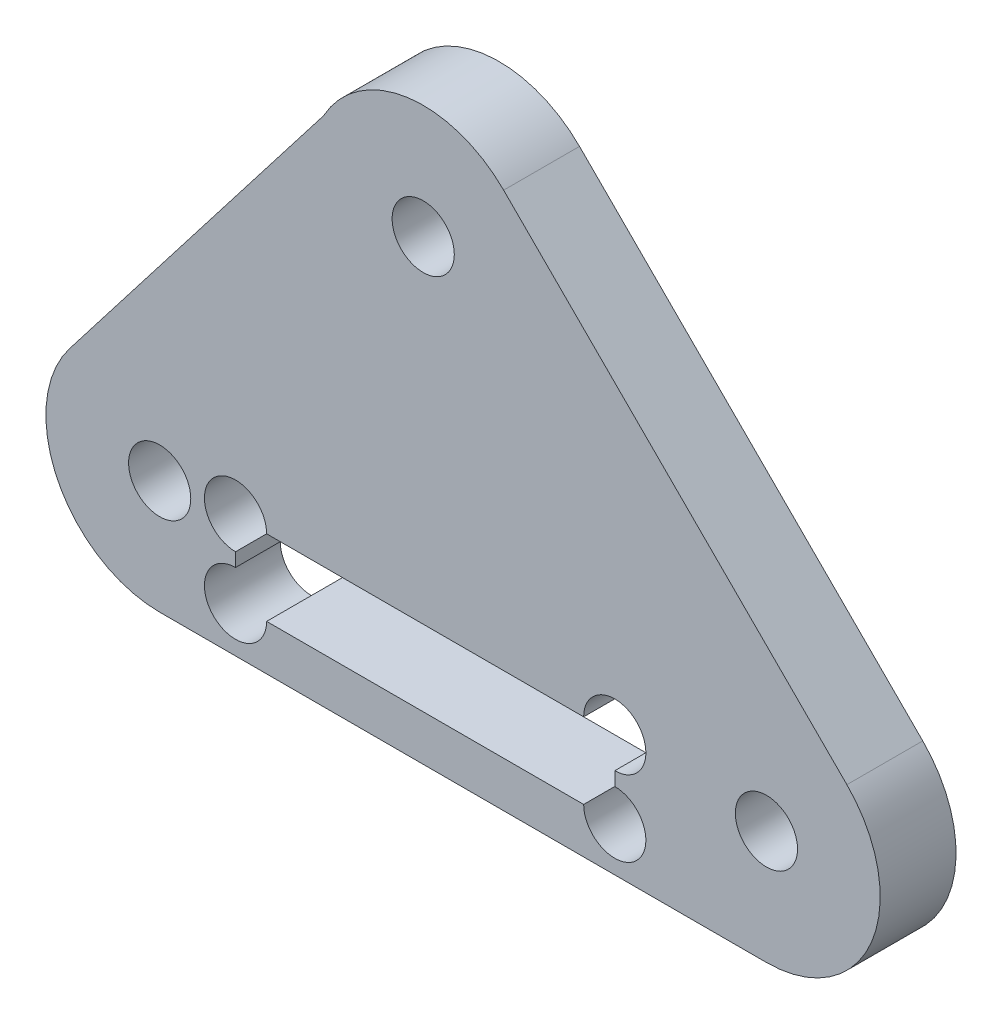
ISO-10303-21;
HEADER;
FILE_DESCRIPTION(('STEP AP214'),'2;1');
FILE_NAME('part.step','',(''),(''),'','','');
FILE_SCHEMA(('AUTOMOTIVE_DESIGN { 1 0 10303 214 1 1 1 1 }'));
ENDSEC;
DATA;
#1=APPLICATION_CONTEXT('core data for automotive mechanical design processes');
#2=APPLICATION_PROTOCOL_DEFINITION('international standard','automotive_design',2000,#1);
#3=PRODUCT_CONTEXT('',#1,'mechanical');
#4=PRODUCT('Part','Part','',(#3));
#5=PRODUCT_RELATED_PRODUCT_CATEGORY('part','',(#4));
#6=PRODUCT_DEFINITION_FORMATION('','',#4);
#7=PRODUCT_DEFINITION_CONTEXT('part definition',#1,'design');
#8=PRODUCT_DEFINITION('design','',#6,#7);
#9=PRODUCT_DEFINITION_SHAPE('','',#8);
#10=(LENGTH_UNIT() NAMED_UNIT(*) SI_UNIT(.MILLI.,.METRE.));
#11=(NAMED_UNIT(*) PLANE_ANGLE_UNIT() SI_UNIT($,.RADIAN.));
#12=(NAMED_UNIT(*) SI_UNIT($,.STERADIAN.) SOLID_ANGLE_UNIT());
#13=UNCERTAINTY_MEASURE_WITH_UNIT(LENGTH_MEASURE(1.E-05),#10,'distance_accuracy_value','');
#14=(GEOMETRIC_REPRESENTATION_CONTEXT(3) GLOBAL_UNCERTAINTY_ASSIGNED_CONTEXT((#13)) GLOBAL_UNIT_ASSIGNED_CONTEXT((#10,
#11,#12)) REPRESENTATION_CONTEXT('',''));
#15=CARTESIAN_POINT('',(0.,0.,0.));
#16=DIRECTION('',(0.,0.,1.));
#17=DIRECTION('',(1.,0.,0.));
#18=AXIS2_PLACEMENT_3D('',#15,#16,#17);
#19=CARTESIAN_POINT('',(0.,0.,5.));
#20=DIRECTION('',(0.,0.,1.));
#21=DIRECTION('',(1.,0.,0.));
#22=AXIS2_PLACEMENT_3D('',#19,#20,#21);
#23=PLANE('',#22);
#24=CARTESIAN_POINT('',(-10.,0.500000000000128,5.));
#25=DIRECTION('',(0.,0.,1.));
#26=DIRECTION('',(1.,0.,0.));
#27=AXIS2_PLACEMENT_3D('',#24,#25,#26);
#28=CIRCLE('',#27,2.05);
#29=CARTESIAN_POINT('',(-10.,-1.54999999999987,5.));
#30=VERTEX_POINT('',#29);
#31=CARTESIAN_POINT('',(-12.05,0.500000000000127,5.));
#32=VERTEX_POINT('',#31);
#33=EDGE_CURVE('E467',#30,#32,#28,.T.);
#34=ORIENTED_EDGE('',*,*,#33,.F.);
#35=DIRECTION('',(0.,1.,0.));
#36=VECTOR('',#35,1.);
#37=CARTESIAN_POINT('',(-10.,-4.49999999999987,5.));
#38=LINE('',#37,#36);
#39=CARTESIAN_POINT('',(-10.,-2.44999999999987,5.));
#40=VERTEX_POINT('',#39);
#41=EDGE_CURVE('E160',#40,#30,#38,.T.);
#42=ORIENTED_EDGE('',*,*,#41,.F.);
#43=CARTESIAN_POINT('',(-10.,-4.49999999999987,5.));
#44=DIRECTION('',(0.,0.,1.));
#45=DIRECTION('',(1.,0.,0.));
#46=AXIS2_PLACEMENT_3D('',#43,#44,#45);
#47=CIRCLE('',#46,2.05);
#48=CARTESIAN_POINT('',(-12.05,-4.49999999999987,5.));
#49=VERTEX_POINT('',#48);
#50=EDGE_CURVE('E59',#49,#40,#47,.T.);
#51=ORIENTED_EDGE('',*,*,#50,.F.);
#52=DIRECTION('',(1.,0.,0.));
#53=VECTOR('',#52,1.);
#54=CARTESIAN_POINT('',(-10.,-4.49999999999987,5.));
#55=LINE('',#54,#53);
#56=CARTESIAN_POINT('',(-32.95,-4.49999999999988,5.));
#57=VERTEX_POINT('',#56);
#58=EDGE_CURVE('E153',#57,#49,#55,.T.);
#59=ORIENTED_EDGE('',*,*,#58,.F.);
#60=CARTESIAN_POINT('',(-35.,-4.49999999999988,5.));
#61=DIRECTION('',(0.,0.,1.));
#62=DIRECTION('',(1.,0.,0.));
#63=AXIS2_PLACEMENT_3D('',#60,#61,#62);
#64=CIRCLE('',#63,2.04999999999999);
#65=CARTESIAN_POINT('',(-35.,-2.44999999999988,5.));
#66=VERTEX_POINT('',#65);
#67=EDGE_CURVE('E51',#66,#57,#64,.T.);
#68=ORIENTED_EDGE('',*,*,#67,.F.);
#69=DIRECTION('',(0.,-1.,0.));
#70=VECTOR('',#69,1.);
#71=CARTESIAN_POINT('',(-35.,-4.49999999999988,5.));
#72=LINE('',#71,#70);
#73=CARTESIAN_POINT('',(-35.,-1.54999999999988,5.));
#74=VERTEX_POINT('',#73);
#75=EDGE_CURVE('E151',#74,#66,#72,.T.);
#76=ORIENTED_EDGE('',*,*,#75,.F.);
#77=CARTESIAN_POINT('',(-35.,0.500000000000124,5.));
#78=DIRECTION('',(0.,0.,1.));
#79=DIRECTION('',(1.,0.,0.));
#80=AXIS2_PLACEMENT_3D('',#77,#78,#79);
#81=CIRCLE('',#80,2.05);
#82=CARTESIAN_POINT('',(-32.95,0.500000000000125,5.));
#83=VERTEX_POINT('',#82);
#84=EDGE_CURVE('E481',#83,#74,#81,.T.);
#85=ORIENTED_EDGE('',*,*,#84,.F.);
#86=DIRECTION('',(-1.,0.,0.));
#87=VECTOR('',#86,1.);
#88=CARTESIAN_POINT('',(-10.,0.500000000000128,5.));
#89=LINE('',#88,#87);
#90=EDGE_CURVE('E171',#32,#83,#89,.T.);
#91=ORIENTED_EDGE('',*,*,#90,.F.);
#92=EDGE_LOOP('',(#34,#42,#51,#59,#68,#76,#85,#91));
#93=FACE_BOUND('',#92,.T.);
#94=CARTESIAN_POINT('',(-22.6274169979697,22.6274169979694,5.));
#95=DIRECTION('',(0.,0.,1.));
#96=DIRECTION('',(1.,0.,0.));
#97=AXIS2_PLACEMENT_3D('',#94,#95,#96);
#98=CIRCLE('',#97,2.05);
#99=CARTESIAN_POINT('',(-20.5774169979697,22.6274169979694,5.));
#100=VERTEX_POINT('',#99);
#101=EDGE_CURVE('E178',#100,#100,#98,.T.);
#102=ORIENTED_EDGE('',*,*,#101,.F.);
#103=EDGE_LOOP('',(#102));
#104=FACE_BOUND('',#103,.T.);
#105=DIRECTION('',(1.,0.,0.));
#106=VECTOR('',#105,1.);
#107=CARTESIAN_POINT('',(-40.,-7.5,5.));
#108=LINE('',#107,#106);
#109=CARTESIAN_POINT('',(-40.,-7.49999999999994,5.));
#110=VERTEX_POINT('',#109);
#111=CARTESIAN_POINT('',(0.,-7.5,5.));
#112=VERTEX_POINT('',#111);
#113=EDGE_CURVE('E189',#110,#112,#108,.T.);
#114=ORIENTED_EDGE('',*,*,#113,.T.);
#115=CARTESIAN_POINT('',(0.,0.,5.));
#116=DIRECTION('',(0.,0.,1.));
#117=DIRECTION('',(1.,0.,0.));
#118=AXIS2_PLACEMENT_3D('',#115,#116,#117);
#119=CIRCLE('',#118,7.49999999999994);
#120=CARTESIAN_POINT('',(5.30330085889905,5.30330085889907,5.));
#121=VERTEX_POINT('',#120);
#122=EDGE_CURVE('E191',#112,#121,#119,.T.);
#123=ORIENTED_EDGE('',*,*,#122,.T.);
#124=DIRECTION('',(-0.707106781186549,0.707106781186546,0.));
#125=VECTOR('',#124,1.);
#126=CARTESIAN_POINT('',(-17.3241161390706,27.9307178568685,5.));
#127=LINE('',#126,#125);
#128=CARTESIAN_POINT('',(-17.3241161390706,27.9307178568685,5.));
#129=VERTEX_POINT('',#128);
#130=EDGE_CURVE('E194',#121,#129,#127,.T.);
#131=ORIENTED_EDGE('',*,*,#130,.T.);
#132=CARTESIAN_POINT('',(-22.6274169979697,22.6274169979694,5.));
#133=DIRECTION('',(0.,0.,1.));
#134=DIRECTION('',(-1.,0.,0.));
#135=AXIS2_PLACEMENT_3D('',#132,#133,#134);
#136=CIRCLE('',#135,7.5);
#137=CARTESIAN_POINT('',(-29.2018159304156,26.2367491629348,5.));
#138=VERTEX_POINT('',#137);
#139=EDGE_CURVE('E196',#129,#138,#136,.T.);
#140=ORIENTED_EDGE('',*,*,#139,.T.);
#141=DIRECTION('',(-0.611506676870263,-0.791239271107727,0.));
#142=VECTOR('',#141,1.);
#143=CARTESIAN_POINT('',(-45.9342945333079,4.5863000765269,5.));
#144=LINE('',#143,#142);
#145=CARTESIAN_POINT('',(-45.9342945333079,4.5863000765269,5.));
#146=VERTEX_POINT('',#145);
#147=EDGE_CURVE('E198',#138,#146,#144,.T.);
#148=ORIENTED_EDGE('',*,*,#147,.T.);
#149=CARTESIAN_POINT('',(-40.,0.,5.));
#150=DIRECTION('',(0.,0.,1.));
#151=DIRECTION('',(-1.,0.,0.));
#152=AXIS2_PLACEMENT_3D('',#149,#150,#151);
#153=CIRCLE('',#152,7.49999999999994);
#154=EDGE_CURVE('E200',#146,#110,#153,.T.);
#155=ORIENTED_EDGE('',*,*,#154,.T.);
#156=EDGE_LOOP('',(#114,#123,#131,#140,#148,#155));
#157=FACE_BOUND('',#156,.T.);
#158=CARTESIAN_POINT('',(0.,0.,5.));
#159=DIRECTION('',(0.,0.,1.));
#160=DIRECTION('',(1.,0.,0.));
#161=AXIS2_PLACEMENT_3D('',#158,#159,#160);
#162=CIRCLE('',#161,2.05);
#163=CARTESIAN_POINT('',(2.05,0.,5.));
#164=VERTEX_POINT('',#163);
#165=EDGE_CURVE('E183',#164,#164,#162,.T.);
#166=ORIENTED_EDGE('',*,*,#165,.F.);
#167=EDGE_LOOP('',(#166));
#168=FACE_BOUND('',#167,.T.);
#169=CARTESIAN_POINT('',(-40.,0.,5.));
#170=DIRECTION('',(0.,0.,1.));
#171=DIRECTION('',(1.,0.,0.));
#172=AXIS2_PLACEMENT_3D('',#169,#170,#171);
#173=CIRCLE('',#172,2.05);
#174=CARTESIAN_POINT('',(-37.95,0.,5.));
#175=VERTEX_POINT('',#174);
#176=EDGE_CURVE('E490',#175,#175,#173,.T.);
#177=ORIENTED_EDGE('',*,*,#176,.F.);
#178=EDGE_LOOP('',(#177));
#179=FACE_BOUND('',#178,.T.);
#180=ADVANCED_FACE('F36',(#93,#104,#157,#168,#179),#23,.T.);
#181=CARTESIAN_POINT('',(0.,0.,0.));
#182=DIRECTION('',(0.,0.,1.));
#183=DIRECTION('',(1.,0.,0.));
#184=AXIS2_PLACEMENT_3D('',#181,#182,#183);
#185=PLANE('',#184);
#186=CARTESIAN_POINT('',(0.,0.,0.));
#187=DIRECTION('',(0.,0.,1.));
#188=DIRECTION('',(1.,0.,0.));
#189=AXIS2_PLACEMENT_3D('',#186,#187,#188);
#190=CIRCLE('',#189,2.05);
#191=CARTESIAN_POINT('',(2.05,0.,0.));
#192=VERTEX_POINT('',#191);
#193=EDGE_CURVE('E174',#192,#192,#190,.T.);
#194=ORIENTED_EDGE('',*,*,#193,.T.);
#195=EDGE_LOOP('',(#194));
#196=FACE_BOUND('',#195,.T.);
#197=DIRECTION('',(1.,0.,0.));
#198=VECTOR('',#197,1.);
#199=CARTESIAN_POINT('',(-22.6274169979696,-7.5,0.));
#200=LINE('',#199,#198);
#201=CARTESIAN_POINT('',(-40.,-7.49999999999994,0.));
#202=VERTEX_POINT('',#201);
#203=CARTESIAN_POINT('',(0.,-7.5,0.));
#204=VERTEX_POINT('',#203);
#205=EDGE_CURVE('E186',#202,#204,#200,.T.);
#206=ORIENTED_EDGE('',*,*,#205,.F.);
#207=CARTESIAN_POINT('',(-40.,0.,0.));
#208=DIRECTION('',(0.,0.,1.));
#209=DIRECTION('',(-1.,0.,0.));
#210=AXIS2_PLACEMENT_3D('',#207,#208,#209);
#211=CIRCLE('',#210,7.49999999999994);
#212=CARTESIAN_POINT('',(-45.9342945333079,4.5863000765269,0.));
#213=VERTEX_POINT('',#212);
#214=EDGE_CURVE('E192',#213,#202,#211,.T.);
#215=ORIENTED_EDGE('',*,*,#214,.F.);
#216=DIRECTION('',(-0.611506676870263,-0.791239271107727,0.));
#217=VECTOR('',#216,1.);
#218=CARTESIAN_POINT('',(-45.9342945333079,4.5863000765269,0.));
#219=LINE('',#218,#217);
#220=CARTESIAN_POINT('',(-29.2018159304156,26.2367491629348,0.));
#221=VERTEX_POINT('',#220);
#222=EDGE_CURVE('E210',#221,#213,#219,.T.);
#223=ORIENTED_EDGE('',*,*,#222,.F.);
#224=CARTESIAN_POINT('',(-22.6274169979697,22.6274169979694,0.));
#225=DIRECTION('',(0.,0.,1.));
#226=DIRECTION('',(-1.,0.,0.));
#227=AXIS2_PLACEMENT_3D('',#224,#225,#226);
#228=CIRCLE('',#227,7.5);
#229=CARTESIAN_POINT('',(-17.3241161390706,27.9307178568685,0.));
#230=VERTEX_POINT('',#229);
#231=EDGE_CURVE('E208',#230,#221,#228,.T.);
#232=ORIENTED_EDGE('',*,*,#231,.F.);
#233=DIRECTION('',(-0.707106781186549,0.707106781186546,0.));
#234=VECTOR('',#233,1.);
#235=CARTESIAN_POINT('',(-17.3241161390706,27.9307178568685,0.));
#236=LINE('',#235,#234);
#237=CARTESIAN_POINT('',(5.30330085889905,5.30330085889907,0.));
#238=VERTEX_POINT('',#237);
#239=EDGE_CURVE('E206',#238,#230,#236,.T.);
#240=ORIENTED_EDGE('',*,*,#239,.F.);
#241=CARTESIAN_POINT('',(0.,0.,0.));
#242=DIRECTION('',(0.,0.,1.));
#243=DIRECTION('',(1.,0.,0.));
#244=AXIS2_PLACEMENT_3D('',#241,#242,#243);
#245=CIRCLE('',#244,7.49999999999994);
#246=EDGE_CURVE('E204',#204,#238,#245,.T.);
#247=ORIENTED_EDGE('',*,*,#246,.F.);
#248=EDGE_LOOP('',(#206,#215,#223,#232,#240,#247));
#249=FACE_BOUND('',#248,.T.);
#250=DIRECTION('',(0.,1.,0.));
#251=VECTOR('',#250,1.);
#252=CARTESIAN_POINT('',(-10.,-4.49999999999987,0.));
#253=LINE('',#252,#251);
#254=CARTESIAN_POINT('',(-10.,-2.44999999999987,0.));
#255=VERTEX_POINT('',#254);
#256=CARTESIAN_POINT('',(-10.,-1.54999999999987,0.));
#257=VERTEX_POINT('',#256);
#258=EDGE_CURVE('E163',#255,#257,#253,.T.);
#259=ORIENTED_EDGE('',*,*,#258,.T.);
#260=CARTESIAN_POINT('',(-10.,0.500000000000128,0.));
#261=DIRECTION('',(0.,0.,1.));
#262=DIRECTION('',(1.,0.,0.));
#263=AXIS2_PLACEMENT_3D('',#260,#261,#262);
#264=CIRCLE('',#263,2.05);
#265=CARTESIAN_POINT('',(-12.05,0.500000000000127,0.));
#266=VERTEX_POINT('',#265);
#267=EDGE_CURVE('E475',#266,#257,#264,.F.);
#268=ORIENTED_EDGE('',*,*,#267,.F.);
#269=DIRECTION('',(-1.,0.,0.));
#270=VECTOR('',#269,1.);
#271=CARTESIAN_POINT('',(-10.,0.500000000000128,0.));
#272=LINE('',#271,#270);
#273=CARTESIAN_POINT('',(-32.95,0.500000000000125,0.));
#274=VERTEX_POINT('',#273);
#275=EDGE_CURVE('E158',#266,#274,#272,.T.);
#276=ORIENTED_EDGE('',*,*,#275,.T.);
#277=CARTESIAN_POINT('',(-35.,0.500000000000124,0.));
#278=DIRECTION('',(0.,0.,1.));
#279=DIRECTION('',(1.,0.,0.));
#280=AXIS2_PLACEMENT_3D('',#277,#278,#279);
#281=CIRCLE('',#280,2.05);
#282=CARTESIAN_POINT('',(-35.,-1.54999999999988,0.));
#283=VERTEX_POINT('',#282);
#284=EDGE_CURVE('E482',#283,#274,#281,.F.);
#285=ORIENTED_EDGE('',*,*,#284,.F.);
#286=DIRECTION('',(0.,-1.,0.));
#287=VECTOR('',#286,1.);
#288=CARTESIAN_POINT('',(-35.,-4.49999999999988,0.));
#289=LINE('',#288,#287);
#290=CARTESIAN_POINT('',(-35.,-2.44999999999988,0.));
#291=VERTEX_POINT('',#290);
#292=EDGE_CURVE('E175',#283,#291,#289,.T.);
#293=ORIENTED_EDGE('',*,*,#292,.T.);
#294=CARTESIAN_POINT('',(-35.,-4.49999999999988,0.));
#295=DIRECTION('',(0.,0.,1.));
#296=DIRECTION('',(1.,0.,0.));
#297=AXIS2_PLACEMENT_3D('',#294,#295,#296);
#298=CIRCLE('',#297,2.04999999999999);
#299=CARTESIAN_POINT('',(-32.95,-4.49999999999988,0.));
#300=VERTEX_POINT('',#299);
#301=EDGE_CURVE('E138',#300,#291,#298,.F.);
#302=ORIENTED_EDGE('',*,*,#301,.F.);
#303=DIRECTION('',(1.,0.,0.));
#304=VECTOR('',#303,1.);
#305=CARTESIAN_POINT('',(-10.,-4.49999999999987,0.));
#306=LINE('',#305,#304);
#307=CARTESIAN_POINT('',(-12.05,-4.49999999999987,0.));
#308=VERTEX_POINT('',#307);
#309=EDGE_CURVE('E177',#300,#308,#306,.T.);
#310=ORIENTED_EDGE('',*,*,#309,.T.);
#311=CARTESIAN_POINT('',(-10.,-4.49999999999987,0.));
#312=DIRECTION('',(0.,0.,1.));
#313=DIRECTION('',(1.,0.,0.));
#314=AXIS2_PLACEMENT_3D('',#311,#312,#313);
#315=CIRCLE('',#314,2.05);
#316=EDGE_CURVE('E479',#255,#308,#315,.F.);
#317=ORIENTED_EDGE('',*,*,#316,.F.);
#318=EDGE_LOOP('',(#259,#268,#276,#285,#293,#302,#310,#317));
#319=FACE_BOUND('',#318,.T.);
#320=CARTESIAN_POINT('',(-22.6274169979697,22.6274169979694,0.));
#321=DIRECTION('',(0.,0.,1.));
#322=DIRECTION('',(1.,0.,0.));
#323=AXIS2_PLACEMENT_3D('',#320,#321,#322);
#324=CIRCLE('',#323,2.05);
#325=CARTESIAN_POINT('',(-20.5774169979697,22.6274169979694,0.));
#326=VERTEX_POINT('',#325);
#327=EDGE_CURVE('E166',#326,#326,#324,.T.);
#328=ORIENTED_EDGE('',*,*,#327,.T.);
#329=EDGE_LOOP('',(#328));
#330=FACE_BOUND('',#329,.T.);
#331=CARTESIAN_POINT('',(-40.,0.,0.));
#332=DIRECTION('',(0.,0.,1.));
#333=DIRECTION('',(1.,0.,0.));
#334=AXIS2_PLACEMENT_3D('',#331,#332,#333);
#335=CIRCLE('',#334,2.05);
#336=CARTESIAN_POINT('',(-37.95,0.,0.));
#337=VERTEX_POINT('',#336);
#338=EDGE_CURVE('E484',#337,#337,#335,.T.);
#339=ORIENTED_EDGE('',*,*,#338,.T.);
#340=EDGE_LOOP('',(#339));
#341=FACE_BOUND('',#340,.T.);
#342=ADVANCED_FACE('F236',(#196,#249,#319,#330,#341),#185,.F.);
#343=CARTESIAN_POINT('',(-22.6274169979696,-7.5,5.));
#344=DIRECTION('',(0.,1.,0.));
#345=DIRECTION('',(-1.,0.,0.));
#346=AXIS2_PLACEMENT_3D('',#343,#344,#345);
#347=PLANE('',#346);
#348=ORIENTED_EDGE('',*,*,#205,.T.);
#349=DIRECTION('',(0.,0.,-1.));
#350=VECTOR('',#349,1.);
#351=CARTESIAN_POINT('',(0.,-7.5,5.));
#352=LINE('',#351,#350);
#353=EDGE_CURVE('E11',#112,#204,#352,.T.);
#354=ORIENTED_EDGE('',*,*,#353,.F.);
#355=ORIENTED_EDGE('',*,*,#113,.F.);
#356=DIRECTION('',(0.,0.,-1.));
#357=VECTOR('',#356,1.);
#358=CARTESIAN_POINT('',(-40.,-7.49999999999994,5.));
#359=LINE('',#358,#357);
#360=EDGE_CURVE('E202',#110,#202,#359,.T.);
#361=ORIENTED_EDGE('',*,*,#360,.T.);
#362=EDGE_LOOP('',(#348,#354,#355,#361));
#363=FACE_BOUND('',#362,.T.);
#364=ADVANCED_FACE('F38',(#363),#347,.F.);
#365=CARTESIAN_POINT('',(0.,0.,5.));
#366=DIRECTION('',(0.,0.,-1.));
#367=DIRECTION('',(-1.,0.,0.));
#368=AXIS2_PLACEMENT_3D('',#365,#366,#367);
#369=CYLINDRICAL_SURFACE('',#368,7.49999999999994);
#370=ORIENTED_EDGE('',*,*,#246,.T.);
#371=DIRECTION('',(0.,0.,-1.));
#372=VECTOR('',#371,1.);
#373=CARTESIAN_POINT('',(5.30330085889905,5.30330085889907,5.));
#374=LINE('',#373,#372);
#375=EDGE_CURVE('E44',#121,#238,#374,.T.);
#376=ORIENTED_EDGE('',*,*,#375,.F.);
#377=ORIENTED_EDGE('',*,*,#122,.F.);
#378=ORIENTED_EDGE('',*,*,#353,.T.);
#379=EDGE_LOOP('',(#370,#376,#377,#378));
#380=FACE_BOUND('',#379,.T.);
#381=ADVANCED_FACE('F254',(#380),#369,.T.);
#382=CARTESIAN_POINT('',(-17.3241161390706,27.9307178568685,5.));
#383=DIRECTION('',(-0.707106781186546,-0.707106781186549,0.));
#384=DIRECTION('',(0.707106781186549,-0.707106781186546,0.));
#385=AXIS2_PLACEMENT_3D('',#382,#383,#384);
#386=PLANE('',#385);
#387=ORIENTED_EDGE('',*,*,#239,.T.);
#388=DIRECTION('',(0.,0.,-1.));
#389=VECTOR('',#388,1.);
#390=CARTESIAN_POINT('',(-17.3241161390706,27.9307178568685,5.));
#391=LINE('',#390,#389);
#392=EDGE_CURVE('E222',#129,#230,#391,.T.);
#393=ORIENTED_EDGE('',*,*,#392,.F.);
#394=ORIENTED_EDGE('',*,*,#130,.F.);
#395=ORIENTED_EDGE('',*,*,#375,.T.);
#396=EDGE_LOOP('',(#387,#393,#394,#395));
#397=FACE_BOUND('',#396,.T.);
#398=ADVANCED_FACE('F229',(#397),#386,.F.);
#399=CARTESIAN_POINT('',(-22.6274169979697,22.6274169979694,5.));
#400=DIRECTION('',(0.,0.,-1.));
#401=DIRECTION('',(-1.,0.,0.));
#402=AXIS2_PLACEMENT_3D('',#399,#400,#401);
#403=CYLINDRICAL_SURFACE('',#402,7.5);
#404=ORIENTED_EDGE('',*,*,#231,.T.);
#405=DIRECTION('',(0.,0.,-1.));
#406=VECTOR('',#405,1.);
#407=CARTESIAN_POINT('',(-29.2018159304156,26.2367491629348,5.));
#408=LINE('',#407,#406);
#409=EDGE_CURVE('E219',#138,#221,#408,.T.);
#410=ORIENTED_EDGE('',*,*,#409,.F.);
#411=ORIENTED_EDGE('',*,*,#139,.F.);
#412=ORIENTED_EDGE('',*,*,#392,.T.);
#413=EDGE_LOOP('',(#404,#410,#411,#412));
#414=FACE_BOUND('',#413,.T.);
#415=ADVANCED_FACE('F242',(#414),#403,.T.);
#416=CARTESIAN_POINT('',(-45.9342945333079,4.5863000765269,5.));
#417=DIRECTION('',(0.791239271107727,-0.611506676870263,0.));
#418=DIRECTION('',(0.611506676870263,0.791239271107727,0.));
#419=AXIS2_PLACEMENT_3D('',#416,#417,#418);
#420=PLANE('',#419);
#421=ORIENTED_EDGE('',*,*,#222,.T.);
#422=DIRECTION('',(0.,0.,-1.));
#423=VECTOR('',#422,1.);
#424=CARTESIAN_POINT('',(-45.9342945333079,4.5863000765269,5.));
#425=LINE('',#424,#423);
#426=EDGE_CURVE('E216',#146,#213,#425,.T.);
#427=ORIENTED_EDGE('',*,*,#426,.F.);
#428=ORIENTED_EDGE('',*,*,#147,.F.);
#429=ORIENTED_EDGE('',*,*,#409,.T.);
#430=EDGE_LOOP('',(#421,#427,#428,#429));
#431=FACE_BOUND('',#430,.T.);
#432=ADVANCED_FACE('F246',(#431),#420,.F.);
#433=CARTESIAN_POINT('',(-40.,0.,5.));
#434=DIRECTION('',(0.,0.,-1.));
#435=DIRECTION('',(-1.,0.,0.));
#436=AXIS2_PLACEMENT_3D('',#433,#434,#435);
#437=CYLINDRICAL_SURFACE('',#436,7.49999999999994);
#438=ORIENTED_EDGE('',*,*,#214,.T.);
#439=ORIENTED_EDGE('',*,*,#360,.F.);
#440=ORIENTED_EDGE('',*,*,#154,.F.);
#441=ORIENTED_EDGE('',*,*,#426,.T.);
#442=EDGE_LOOP('',(#438,#439,#440,#441));
#443=FACE_BOUND('',#442,.T.);
#444=ADVANCED_FACE('F257',(#443),#437,.T.);
#445=CARTESIAN_POINT('',(0.,0.,5.));
#446=DIRECTION('',(0.,0.,-1.));
#447=DIRECTION('',(-1.,0.,0.));
#448=AXIS2_PLACEMENT_3D('',#445,#446,#447);
#449=CYLINDRICAL_SURFACE('',#448,2.05);
#450=ORIENTED_EDGE('',*,*,#165,.T.);
#451=EDGE_LOOP('',(#450));
#452=FACE_BOUND('',#451,.T.);
#453=ORIENTED_EDGE('',*,*,#193,.F.);
#454=EDGE_LOOP('',(#453));
#455=FACE_BOUND('',#454,.T.);
#456=ADVANCED_FACE('F259',(#452,#455),#449,.F.);
#457=CARTESIAN_POINT('',(-35.,-4.49999999999988,5.));
#458=DIRECTION('',(1.,0.,0.));
#459=DIRECTION('',(0.,1.,0.));
#460=AXIS2_PLACEMENT_3D('',#457,#458,#459);
#461=PLANE('',#460);
#462=DIRECTION('',(0.,0.,1.));
#463=VECTOR('',#462,1.);
#464=CARTESIAN_POINT('',(-35.,-2.44999999999988,-0.00100000000000013));
#465=LINE('',#464,#463);
#466=EDGE_CURVE('E135',#66,#291,#465,.F.);
#467=ORIENTED_EDGE('',*,*,#466,.T.);
#468=ORIENTED_EDGE('',*,*,#292,.F.);
#469=DIRECTION('',(0.,0.,1.));
#470=VECTOR('',#469,1.);
#471=CARTESIAN_POINT('',(-35.,-1.54999999999988,-0.00100000000000013));
#472=LINE('',#471,#470);
#473=EDGE_CURVE('E157',#283,#74,#472,.T.);
#474=ORIENTED_EDGE('',*,*,#473,.T.);
#475=ORIENTED_EDGE('',*,*,#75,.T.);
#476=EDGE_LOOP('',(#467,#468,#474,#475));
#477=FACE_BOUND('',#476,.T.);
#478=ADVANCED_FACE('F156',(#477),#461,.T.);
#479=CARTESIAN_POINT('',(-10.,-4.49999999999987,5.));
#480=DIRECTION('',(0.,1.,0.));
#481=DIRECTION('',(-1.,0.,0.));
#482=AXIS2_PLACEMENT_3D('',#479,#480,#481);
#483=PLANE('',#482);
#484=DIRECTION('',(0.,0.,1.));
#485=VECTOR('',#484,1.);
#486=CARTESIAN_POINT('',(-12.05,-4.49999999999987,-0.00100000000000013));
#487=LINE('',#486,#485);
#488=EDGE_CURVE('E510',#49,#308,#487,.F.);
#489=ORIENTED_EDGE('',*,*,#488,.T.);
#490=ORIENTED_EDGE('',*,*,#309,.F.);
#491=DIRECTION('',(0.,0.,1.));
#492=VECTOR('',#491,1.);
#493=CARTESIAN_POINT('',(-32.95,-4.49999999999988,-0.00100000000000013));
#494=LINE('',#493,#492);
#495=EDGE_CURVE('E143',#300,#57,#494,.T.);
#496=ORIENTED_EDGE('',*,*,#495,.T.);
#497=ORIENTED_EDGE('',*,*,#58,.T.);
#498=EDGE_LOOP('',(#489,#490,#496,#497));
#499=FACE_BOUND('',#498,.T.);
#500=ADVANCED_FACE('F278',(#499),#483,.T.);
#501=CARTESIAN_POINT('',(-10.,-4.49999999999987,5.));
#502=DIRECTION('',(-1.,0.,0.));
#503=DIRECTION('',(0.,0.,1.));
#504=AXIS2_PLACEMENT_3D('',#501,#502,#503);
#505=PLANE('',#504);
#506=DIRECTION('',(0.,0.,1.));
#507=VECTOR('',#506,1.);
#508=CARTESIAN_POINT('',(-10.,-1.54999999999987,-0.00100000000000013));
#509=LINE('',#508,#507);
#510=EDGE_CURVE('E472',#30,#257,#509,.F.);
#511=ORIENTED_EDGE('',*,*,#510,.T.);
#512=ORIENTED_EDGE('',*,*,#258,.F.);
#513=DIRECTION('',(0.,0.,1.));
#514=VECTOR('',#513,1.);
#515=CARTESIAN_POINT('',(-10.,-2.44999999999987,-0.00100000000000013));
#516=LINE('',#515,#514);
#517=EDGE_CURVE('E508',#255,#40,#516,.T.);
#518=ORIENTED_EDGE('',*,*,#517,.T.);
#519=ORIENTED_EDGE('',*,*,#41,.T.);
#520=EDGE_LOOP('',(#511,#512,#518,#519));
#521=FACE_BOUND('',#520,.T.);
#522=ADVANCED_FACE('F281',(#521),#505,.T.);
#523=CARTESIAN_POINT('',(-10.,0.500000000000128,5.));
#524=DIRECTION('',(0.,-1.,0.));
#525=DIRECTION('',(1.,0.,0.));
#526=AXIS2_PLACEMENT_3D('',#523,#524,#525);
#527=PLANE('',#526);
#528=DIRECTION('',(0.,0.,1.));
#529=VECTOR('',#528,1.);
#530=CARTESIAN_POINT('',(-12.05,0.500000000000127,-0.00100000000000013));
#531=LINE('',#530,#529);
#532=EDGE_CURVE('E469',#266,#32,#531,.T.);
#533=ORIENTED_EDGE('',*,*,#532,.T.);
#534=ORIENTED_EDGE('',*,*,#90,.T.);
#535=DIRECTION('',(0.,0.,1.));
#536=VECTOR('',#535,1.);
#537=CARTESIAN_POINT('',(-32.95,0.500000000000125,-0.00100000000000013));
#538=LINE('',#537,#536);
#539=EDGE_CURVE('E486',#83,#274,#538,.F.);
#540=ORIENTED_EDGE('',*,*,#539,.T.);
#541=ORIENTED_EDGE('',*,*,#275,.F.);
#542=EDGE_LOOP('',(#533,#534,#540,#541));
#543=FACE_BOUND('',#542,.T.);
#544=ADVANCED_FACE('F285',(#543),#527,.T.);
#545=CARTESIAN_POINT('',(-22.6274169979697,22.6274169979694,5.));
#546=DIRECTION('',(0.,0.,-1.));
#547=DIRECTION('',(-1.,0.,0.));
#548=AXIS2_PLACEMENT_3D('',#545,#546,#547);
#549=CYLINDRICAL_SURFACE('',#548,2.05);
#550=ORIENTED_EDGE('',*,*,#101,.T.);
#551=EDGE_LOOP('',(#550));
#552=FACE_BOUND('',#551,.T.);
#553=ORIENTED_EDGE('',*,*,#327,.F.);
#554=EDGE_LOOP('',(#553));
#555=FACE_BOUND('',#554,.T.);
#556=ADVANCED_FACE('F289',(#552,#555),#549,.F.);
#557=CARTESIAN_POINT('',(-40.,0.,5.));
#558=DIRECTION('',(0.,0.,-1.));
#559=DIRECTION('',(-1.,0.,0.));
#560=AXIS2_PLACEMENT_3D('',#557,#558,#559);
#561=CYLINDRICAL_SURFACE('',#560,2.05);
#562=ORIENTED_EDGE('',*,*,#176,.T.);
#563=EDGE_LOOP('',(#562));
#564=FACE_BOUND('',#563,.T.);
#565=ORIENTED_EDGE('',*,*,#338,.F.);
#566=EDGE_LOOP('',(#565));
#567=FACE_BOUND('',#566,.T.);
#568=ADVANCED_FACE('F293',(#564,#567),#561,.F.);
#569=CARTESIAN_POINT('',(-35.,0.500000000000124,-0.00100000000000013));
#570=DIRECTION('',(0.,0.,1.));
#571=DIRECTION('',(1.,0.,0.));
#572=AXIS2_PLACEMENT_3D('',#569,#570,#571);
#573=CYLINDRICAL_SURFACE('',#572,2.05);
#574=ORIENTED_EDGE('',*,*,#284,.T.);
#575=ORIENTED_EDGE('',*,*,#539,.F.);
#576=ORIENTED_EDGE('',*,*,#84,.T.);
#577=ORIENTED_EDGE('',*,*,#473,.F.);
#578=EDGE_LOOP('',(#574,#575,#576,#577));
#579=FACE_BOUND('',#578,.T.);
#580=ADVANCED_FACE('F297',(#579),#573,.F.);
#581=CARTESIAN_POINT('',(-10.,0.500000000000128,-0.00100000000000013));
#582=DIRECTION('',(0.,0.,1.));
#583=DIRECTION('',(1.,0.,0.));
#584=AXIS2_PLACEMENT_3D('',#581,#582,#583);
#585=CYLINDRICAL_SURFACE('',#584,2.05);
#586=ORIENTED_EDGE('',*,*,#33,.T.);
#587=ORIENTED_EDGE('',*,*,#532,.F.);
#588=ORIENTED_EDGE('',*,*,#267,.T.);
#589=ORIENTED_EDGE('',*,*,#510,.F.);
#590=EDGE_LOOP('',(#586,#587,#588,#589));
#591=FACE_BOUND('',#590,.T.);
#592=ADVANCED_FACE('F301',(#591),#585,.F.);
#593=CARTESIAN_POINT('',(-10.,-4.49999999999987,-0.00100000000000013));
#594=DIRECTION('',(0.,0.,1.));
#595=DIRECTION('',(1.,0.,0.));
#596=AXIS2_PLACEMENT_3D('',#593,#594,#595);
#597=CYLINDRICAL_SURFACE('',#596,2.05);
#598=ORIENTED_EDGE('',*,*,#50,.T.);
#599=ORIENTED_EDGE('',*,*,#517,.F.);
#600=ORIENTED_EDGE('',*,*,#316,.T.);
#601=ORIENTED_EDGE('',*,*,#488,.F.);
#602=EDGE_LOOP('',(#598,#599,#600,#601));
#603=FACE_BOUND('',#602,.T.);
#604=ADVANCED_FACE('F305',(#603),#597,.F.);
#605=CARTESIAN_POINT('',(-35.,-4.49999999999988,-0.00100000000000013));
#606=DIRECTION('',(0.,0.,1.));
#607=DIRECTION('',(1.,0.,0.));
#608=AXIS2_PLACEMENT_3D('',#605,#606,#607);
#609=CYLINDRICAL_SURFACE('',#608,2.04999999999999);
#610=ORIENTED_EDGE('',*,*,#67,.T.);
#611=ORIENTED_EDGE('',*,*,#495,.F.);
#612=ORIENTED_EDGE('',*,*,#301,.T.);
#613=ORIENTED_EDGE('',*,*,#466,.F.);
#614=EDGE_LOOP('',(#610,#611,#612,#613));
#615=FACE_BOUND('',#614,.T.);
#616=ADVANCED_FACE('F136',(#615),#609,.F.);
#617=CLOSED_SHELL('',(#180,#342,#364,#381,#398,#415,#432,#444,#456,#478,#500,#522,#544,#556,
#568,#580,#592,#604,#616));
#618=MANIFOLD_SOLID_BREP('B2',#617);
#619=ADVANCED_BREP_SHAPE_REPRESENTATION('',(#18,#618),#14);
#620=SHAPE_DEFINITION_REPRESENTATION(#9,#619);
ENDSEC;
END-ISO-10303-21;
